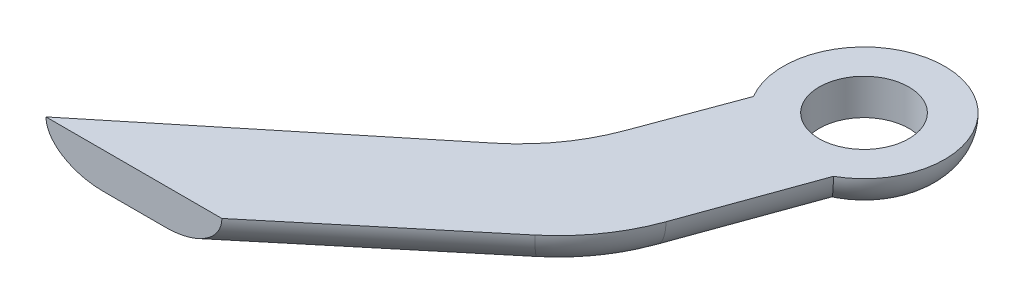
ISO-10303-21;
HEADER;
FILE_DESCRIPTION(('STEP AP214'),'2;1');
FILE_NAME('part.step','',(''),(''),'','','');
FILE_SCHEMA(('AUTOMOTIVE_DESIGN { 1 0 10303 214 1 1 1 1 }'));
ENDSEC;
DATA;
#1=APPLICATION_CONTEXT('core data for automotive mechanical design processes');
#2=APPLICATION_PROTOCOL_DEFINITION('international standard','automotive_design',2000,#1);
#3=PRODUCT_CONTEXT('',#1,'mechanical');
#4=PRODUCT('Part','Part','',(#3));
#5=PRODUCT_RELATED_PRODUCT_CATEGORY('part','',(#4));
#6=PRODUCT_DEFINITION_FORMATION('','',#4);
#7=PRODUCT_DEFINITION_CONTEXT('part definition',#1,'design');
#8=PRODUCT_DEFINITION('design','',#6,#7);
#9=PRODUCT_DEFINITION_SHAPE('','',#8);
#10=(LENGTH_UNIT() NAMED_UNIT(*) SI_UNIT(.MILLI.,.METRE.));
#11=(NAMED_UNIT(*) PLANE_ANGLE_UNIT() SI_UNIT($,.RADIAN.));
#12=(NAMED_UNIT(*) SI_UNIT($,.STERADIAN.) SOLID_ANGLE_UNIT());
#13=UNCERTAINTY_MEASURE_WITH_UNIT(LENGTH_MEASURE(1.E-05),#10,'distance_accuracy_value','');
#14=(GEOMETRIC_REPRESENTATION_CONTEXT(3) GLOBAL_UNCERTAINTY_ASSIGNED_CONTEXT((#13)) GLOBAL_UNIT_ASSIGNED_CONTEXT((#10,
#11,#12)) REPRESENTATION_CONTEXT('',''));
#15=CARTESIAN_POINT('',(0.,0.,0.));
#16=DIRECTION('',(0.,0.,1.));
#17=DIRECTION('',(1.,0.,0.));
#18=AXIS2_PLACEMENT_3D('',#15,#16,#17);
#19=CARTESIAN_POINT('',(11.4826257965562,2.,-14.3996307201945));
#20=DIRECTION('',(0.,1.,0.));
#21=DIRECTION('',(0.,0.,1.));
#22=AXIS2_PLACEMENT_3D('',#19,#20,#21);
#23=PLANE('',#22);
#24=DIRECTION('',(0.768811989561023,0.,-0.639474881998676));
#25=VECTOR('',#24,1.);
#26=CARTESIAN_POINT('',(-1.31921636014026,2.,8.60036927980545));
#27=LINE('',#26,#25);
#28=CARTESIAN_POINT('',(-1.31921636014026,2.,8.60036927980545));
#29=VERTEX_POINT('',#28);
#30=CARTESIAN_POINT('',(8.20702119077927,2.,0.676729018622842));
#31=VERTEX_POINT('',#30);
#32=EDGE_CURVE('E124',#29,#31,#27,.T.);
#33=ORIENTED_EDGE('',*,*,#32,.T.);
#34=CARTESIAN_POINT('',(1.8122723707925,2.,-7.01139087698739));
#35=DIRECTION('',(0.,1.,0.));
#36=DIRECTION('',(0.,0.,1.));
#37=AXIS2_PLACEMENT_3D('',#34,#35,#36);
#38=CIRCLE('',#37,10.);
#39=CARTESIAN_POINT('',(11.2193056553227,2.,-3.6190871194002));
#40=VERTEX_POINT('',#39);
#41=EDGE_CURVE('E202',#31,#40,#38,.T.);
#42=ORIENTED_EDGE('',*,*,#41,.T.);
#43=DIRECTION('',(0.339230375758719,0.,-0.940703328453024));
#44=VECTOR('',#43,1.);
#45=CARTESIAN_POINT('',(10.2970860518292,2.,-1.06172459362196));
#46=LINE('',#45,#44);
#47=CARTESIAN_POINT('',(13.693514413313,2.,-10.4801956174922));
#48=VERTEX_POINT('',#47);
#49=EDGE_CURVE('E199',#40,#48,#46,.T.);
#50=ORIENTED_EDGE('',*,*,#49,.T.);
#51=CARTESIAN_POINT('',(11.4826257965562,2.,-14.3996307201945));
#52=DIRECTION('',(0.,1.,0.));
#53=DIRECTION('',(0.,0.,1.));
#54=AXIS2_PLACEMENT_3D('',#51,#52,#53);
#55=CIRCLE('',#54,4.5);
#56=CARTESIAN_POINT('',(7.61190342688268,2.,-12.1045254204515));
#57=VERTEX_POINT('',#56);
#58=EDGE_CURVE('E196',#48,#57,#55,.T.);
#59=ORIENTED_EDGE('',*,*,#58,.T.);
#60=DIRECTION('',(-0.347398248181745,0.,0.937717685212482));
#61=VECTOR('',#60,1.);
#62=CARTESIAN_POINT('',(7.61190342688268,2.,-12.1045254204515));
#63=LINE('',#62,#61);
#64=CARTESIAN_POINT('',(5.68031595775114,2.,-6.89067146517223));
#65=VERTEX_POINT('',#64);
#66=EDGE_CURVE('E115',#57,#65,#63,.T.);
#67=ORIENTED_EDGE('',*,*,#66,.T.);
#68=CARTESIAN_POINT('',(-3.69686089437368,2.,-10.3646539469897));
#69=DIRECTION('',(0.,1.,0.));
#70=DIRECTION('',(0.,0.,1.));
#71=AXIS2_PLACEMENT_3D('',#68,#69,#70);
#72=CIRCLE('',#71,10.);
#73=CARTESIAN_POINT('',(2.62475748019861,2.,-2.61629017608488));
#74=VERTEX_POINT('',#73);
#75=EDGE_CURVE('E110',#65,#74,#72,.F.);
#76=ORIENTED_EDGE('',*,*,#75,.T.);
#77=DIRECTION('',(-0.77483637709048,0.,0.632161837457229));
#78=VECTOR('',#77,1.);
#79=CARTESIAN_POINT('',(4.73443918794363,2.,-4.33750552457679));
#80=LINE('',#79,#78);
#81=CARTESIAN_POINT('',(-11.1234241734397,2.,8.60036927980545));
#82=VERTEX_POINT('',#81);
#83=EDGE_CURVE('E103',#74,#82,#80,.T.);
#84=ORIENTED_EDGE('',*,*,#83,.T.);
#85=DIRECTION('',(1.,0.,0.));
#86=VECTOR('',#85,1.);
#87=CARTESIAN_POINT('',(-11.1234241734397,2.,8.60036927980545));
#88=LINE('',#87,#86);
#89=EDGE_CURVE('E106',#82,#29,#88,.T.);
#90=ORIENTED_EDGE('',*,*,#89,.T.);
#91=EDGE_LOOP('',(#33,#42,#50,#59,#67,#76,#84,#90));
#92=FACE_BOUND('',#91,.T.);
#93=CARTESIAN_POINT('',(11.4826257965562,2.,-14.3996307201945));
#94=DIRECTION('',(0.,1.,0.));
#95=DIRECTION('',(0.,0.,1.));
#96=AXIS2_PLACEMENT_3D('',#93,#94,#95);
#97=CIRCLE('',#96,2.5);
#98=CARTESIAN_POINT('',(11.4826257965562,2.,-11.8996307201945));
#99=VERTEX_POINT('',#98);
#100=EDGE_CURVE('E186',#99,#99,#97,.T.);
#101=ORIENTED_EDGE('',*,*,#100,.F.);
#102=EDGE_LOOP('',(#101));
#103=FACE_BOUND('',#102,.T.);
#104=ADVANCED_FACE('F34',(#92,#103),#23,.T.);
#105=CARTESIAN_POINT('',(11.4826257965562,0.,-14.3996307201945));
#106=DIRECTION('',(0.,1.,0.));
#107=DIRECTION('',(0.,0.,1.));
#108=AXIS2_PLACEMENT_3D('',#105,#106,#107);
#109=PLANE('',#108);
#110=DIRECTION('',(-0.347398248181745,0.,0.937717685212482));
#111=VECTOR('',#110,1.);
#112=CARTESIAN_POINT('',(10.7021359294715,0.,-14.6887804470523));
#113=LINE('',#112,#111);
#114=CARTESIAN_POINT('',(7.5557513281761,0.,-6.19587496880874));
#115=VERTEX_POINT('',#114);
#116=CARTESIAN_POINT('',(9.88318716538032,0.,-12.4782260087654));
#117=VERTEX_POINT('',#116);
#118=EDGE_CURVE('E54',#115,#117,#113,.F.);
#119=ORIENTED_EDGE('',*,*,#118,.T.);
#120=CARTESIAN_POINT('',(11.4826257965562,0.,-14.3996307201945));
#121=DIRECTION('',(0.,1.,0.));
#122=DIRECTION('',(0.,0.,1.));
#123=AXIS2_PLACEMENT_3D('',#120,#121,#122);
#124=CIRCLE('',#123,2.5);
#125=CARTESIAN_POINT('',(12.1079729417804,0.,-11.9791057878793));
#126=VERTEX_POINT('',#125);
#127=EDGE_CURVE('E138',#117,#126,#124,.T.);
#128=ORIENTED_EDGE('',*,*,#127,.T.);
#129=DIRECTION('',(0.339230375758719,0.,-0.940703328453024));
#130=VECTOR('',#129,1.);
#131=CARTESIAN_POINT('',(12.8084358747006,0.,-13.921525628621));
#132=LINE('',#131,#130);
#133=CARTESIAN_POINT('',(9.3378989984167,0.,-4.29754787091764));
#134=VERTEX_POINT('',#133);
#135=EDGE_CURVE('E61',#126,#134,#132,.F.);
#136=ORIENTED_EDGE('',*,*,#135,.T.);
#137=CARTESIAN_POINT('',(1.8122723707925,0.,-7.01139087698739));
#138=DIRECTION('',(0.,1.,0.));
#139=DIRECTION('',(0.,0.,1.));
#140=AXIS2_PLACEMENT_3D('',#137,#138,#139);
#141=CIRCLE('',#140,8.);
#142=CARTESIAN_POINT('',(6.92807142678192,0.,-0.860894960499205));
#143=VERTEX_POINT('',#142);
#144=EDGE_CURVE('E214',#134,#143,#141,.F.);
#145=ORIENTED_EDGE('',*,*,#144,.T.);
#146=DIRECTION('',(0.768811989561023,0.,-0.639474881998676));
#147=VECTOR('',#146,1.);
#148=CARTESIAN_POINT('',(16.2762697216083,0.,-8.63644747873922));
#149=LINE('',#148,#147);
#150=CARTESIAN_POINT('',(-4.44678251840594,0.,8.60036927980545));
#151=VERTEX_POINT('',#150);
#152=EDGE_CURVE('E212',#143,#151,#149,.F.);
#153=ORIENTED_EDGE('',*,*,#152,.T.);
#154=DIRECTION('',(1.,0.,0.));
#155=VECTOR('',#154,1.);
#156=CARTESIAN_POINT('',(-11.1234241734397,0.,8.60036927980545));
#157=LINE('',#156,#155);
#158=CARTESIAN_POINT('',(-7.95967735815469,0.,8.60036927980545));
#159=VERTEX_POINT('',#158);
#160=EDGE_CURVE('E208',#159,#151,#157,.T.);
#161=ORIENTED_EDGE('',*,*,#160,.F.);
#162=DIRECTION('',(-0.77483637709048,0.,0.632161837457229));
#163=VECTOR('',#162,1.);
#164=CARTESIAN_POINT('',(14.9788313460514,0.,-10.1143558411684));
#165=LINE('',#164,#163);
#166=CARTESIAN_POINT('',(3.88908115511307,0.,-1.06661742190392));
#167=VERTEX_POINT('',#166);
#168=EDGE_CURVE('E128',#159,#167,#165,.F.);
#169=ORIENTED_EDGE('',*,*,#168,.T.);
#170=CARTESIAN_POINT('',(-3.69686089437368,0.,-10.3646539469897));
#171=DIRECTION('',(0.,1.,0.));
#172=DIRECTION('',(0.,0.,1.));
#173=AXIS2_PLACEMENT_3D('',#170,#171,#172);
#174=CIRCLE('',#173,12.);
#175=EDGE_CURVE('E218',#167,#115,#174,.T.);
#176=ORIENTED_EDGE('',*,*,#175,.T.);
#177=EDGE_LOOP('',(#119,#128,#136,#145,#153,#161,#169,#176));
#178=FACE_BOUND('',#177,.T.);
#179=ADVANCED_FACE('F172',(#178),#109,.F.);
#180=CARTESIAN_POINT('',(-11.1234241734397,2.,8.60036927980545));
#181=DIRECTION('',(0.,0.,-1.));
#182=DIRECTION('',(-1.,0.,0.));
#183=AXIS2_PLACEMENT_3D('',#180,#181,#182);
#184=PLANE('',#183);
#185=ORIENTED_EDGE('',*,*,#89,.F.);
#186=CARTESIAN_POINT('',(-7.95967735815469,2.,8.60036927980545));
#187=DIRECTION('',(0.,0.,-1.));
#188=DIRECTION('',(-1.,0.,0.));
#189=AXIS2_PLACEMENT_3D('',#186,#187,#188);
#190=ELLIPSE('',#189,3.16374681528496,2.);
#191=EDGE_CURVE('E120',#82,#159,#190,.F.);
#192=ORIENTED_EDGE('',*,*,#191,.T.);
#193=ORIENTED_EDGE('',*,*,#160,.T.);
#194=CARTESIAN_POINT('',(-4.44678251840594,2.,8.60036927980545));
#195=DIRECTION('',(0.,0.,-1.));
#196=DIRECTION('',(1.,0.,0.));
#197=AXIS2_PLACEMENT_3D('',#194,#195,#196);
#198=ELLIPSE('',#197,3.12756615826568,2.);
#199=EDGE_CURVE('E123',#151,#29,#198,.F.);
#200=ORIENTED_EDGE('',*,*,#199,.T.);
#201=EDGE_LOOP('',(#185,#192,#193,#200));
#202=FACE_BOUND('',#201,.T.);
#203=ADVANCED_FACE('F118',(#202),#184,.F.);
#204=CARTESIAN_POINT('',(11.4826257965562,2.,-14.3996307201945));
#205=DIRECTION('',(0.,-1.,0.));
#206=DIRECTION('',(0.,0.,-1.));
#207=AXIS2_PLACEMENT_3D('',#204,#205,#206);
#208=CYLINDRICAL_SURFACE('',#207,2.5);
#209=ORIENTED_EDGE('',*,*,#100,.T.);
#210=EDGE_LOOP('',(#209));
#211=FACE_BOUND('',#210,.T.);
#212=EDGE_CURVE('E190',#126,#117,#124,.T.);
#213=ORIENTED_EDGE('',*,*,#212,.F.);
#214=ORIENTED_EDGE('',*,*,#127,.F.);
#215=EDGE_LOOP('',(#213,#214));
#216=FACE_BOUND('',#215,.T.);
#217=ADVANCED_FACE('F159',(#211,#216),#208,.F.);
#218=CARTESIAN_POINT('',(5.99876286285809,2.,-2.78783277039583));
#219=DIRECTION('',(-0.77483637709048,0.,0.632161837457229));
#220=DIRECTION('',(0.632161837457229,0.,0.77483637709048));
#221=AXIS2_PLACEMENT_3D('',#218,#219,#220);
#222=CYLINDRICAL_SURFACE('',#221,2.);
#223=ORIENTED_EDGE('',*,*,#191,.F.);
#224=ORIENTED_EDGE('',*,*,#83,.F.);
#225=CARTESIAN_POINT('',(3.88908115511307,2.,-1.06661742190392));
#226=DIRECTION('',(0.77483637709048,0.,-0.632161837457229));
#227=DIRECTION('',(-0.632161837457229,0.,-0.77483637709048));
#228=AXIS2_PLACEMENT_3D('',#225,#226,#227);
#229=CIRCLE('',#228,2.);
#230=EDGE_CURVE('E135',#167,#74,#229,.T.);
#231=ORIENTED_EDGE('',*,*,#230,.F.);
#232=ORIENTED_EDGE('',*,*,#168,.F.);
#233=EDGE_LOOP('',(#223,#224,#231,#232));
#234=FACE_BOUND('',#233,.T.);
#235=ADVANCED_FACE('F127',(#234),#222,.T.);
#236=CARTESIAN_POINT('',(-3.69686089437368,2.,-10.3646539469897));
#237=DIRECTION('',(0.,1.,0.));
#238=DIRECTION('',(0.,0.,1.));
#239=AXIS2_PLACEMENT_3D('',#236,#237,#238);
#240=TOROIDAL_SURFACE('',#239,12.,2.);
#241=ORIENTED_EDGE('',*,*,#230,.T.);
#242=ORIENTED_EDGE('',*,*,#75,.F.);
#243=CARTESIAN_POINT('',(7.5557513281761,2.,-6.19587496880874));
#244=DIRECTION('',(0.347398248181745,0.,-0.937717685212482));
#245=DIRECTION('',(-0.937717685212482,0.,-0.347398248181745));
#246=AXIS2_PLACEMENT_3D('',#243,#244,#245);
#247=CIRCLE('',#246,2.);
#248=EDGE_CURVE('E133',#115,#65,#247,.T.);
#249=ORIENTED_EDGE('',*,*,#248,.F.);
#250=ORIENTED_EDGE('',*,*,#175,.F.);
#251=EDGE_LOOP('',(#241,#242,#249,#250));
#252=FACE_BOUND('',#251,.T.);
#253=ADVANCED_FACE('F152',(#252),#240,.T.);
#254=CARTESIAN_POINT('',(9.48733879730765,2.,-11.409728924088));
#255=DIRECTION('',(-0.347398248181745,0.,0.937717685212482));
#256=DIRECTION('',(0.937717685212482,0.,0.347398248181745));
#257=AXIS2_PLACEMENT_3D('',#254,#255,#256);
#258=CYLINDRICAL_SURFACE('',#257,2.);
#259=ORIENTED_EDGE('',*,*,#66,.F.);
#260=CARTESIAN_POINT('',(7.61190342688268,2.,-12.1045254204515));
#261=CARTESIAN_POINT('',(7.61189543352078,1.94797161246337,-12.1045262232534));
#262=CARTESIAN_POINT('',(7.61414339430645,1.89594703558025,-12.1047280739774));
#263=CARTESIAN_POINT('',(7.62308994926808,1.79229556153906,-12.105539429095));
#264=CARTESIAN_POINT('',(7.62978763009234,1.74066858496881,-12.1061488498307));
#265=CARTESIAN_POINT('',(7.6475467799877,1.63832832712275,-12.1077785477575));
#266=CARTESIAN_POINT('',(7.65859562252087,1.58761284216087,-12.1087976363189));
#267=CARTESIAN_POINT('',(7.68492912514579,1.48731807740263,-12.1112567415172));
#268=CARTESIAN_POINT('',(7.70021385815536,1.43773881718148,-12.1126967654001));
#269=CARTESIAN_POINT('',(7.75219834246821,1.29125228992072,-12.1176685979388));
#270=CARTESIAN_POINT('',(7.79504999413708,1.19647368864975,-12.1218540280005));
#271=CARTESIAN_POINT('',(7.89544489323164,1.01521923926278,-12.1321135387336));
#272=CARTESIAN_POINT('',(7.95299390003438,0.928746664308471,-12.1381883599949));
#273=CARTESIAN_POINT('',(8.08277301030972,0.76331630024433,-12.1526471361493));
#274=CARTESIAN_POINT('',(8.15541305794058,0.68468644081365,-12.1610986019576));
#275=CARTESIAN_POINT('',(8.31166308370237,0.539619289635113,-12.1804522363457));
#276=CARTESIAN_POINT('',(8.39527542737518,0.473184634508815,-12.1913549337545));
#277=CARTESIAN_POINT('',(8.57861945643107,0.348091659981006,-12.2169281844484));
#278=CARTESIAN_POINT('',(8.67912074017512,0.290613681895938,-12.23184411115));
#279=CARTESIAN_POINT('',(8.88709032135319,0.191352219674169,-12.2651943235526));
#280=CARTESIAN_POINT('',(8.99456485297788,0.149583012573472,-12.2836317869956));
#281=CARTESIAN_POINT('',(9.22965456264571,0.0765945474507016,-12.327317552917));
#282=CARTESIAN_POINT('',(9.35791266490508,0.0478193952913946,-12.3531680620895));
#283=CARTESIAN_POINT('',(9.61586564248933,0.00975062089641697,-12.4103304088893));
#284=CARTESIAN_POINT('',(9.74555771894424,0.000424111407126259,-12.4416329299717));
#285=CARTESIAN_POINT('',(9.87725407027953,4.69634166260889E-06,-12.4766436593888));
#286=CARTESIAN_POINT('',(9.88022088463565,-1.59677907326687E-08,-12.4774340574169));
#287=CARTESIAN_POINT('',(9.88318716538032,0.,-12.4782260087654));
#288=B_SPLINE_CURVE_WITH_KNOTS('',3,(#260,#261,#262,#263,#264,#265,#266,#267,#268,#269,#270,
#271,#272,#273,#274,#275,#276,#277,#278,#279,#280,#281,#282,#283,#284,#285,#286,#287),
.UNSPECIFIED.,.F.,.F.,(4,2,2,2,2,2,2,2,2,2,2,2,2,4),(0.,0.156029713161231,0.312027409478255,
0.467575716396317,0.62312670113319,0.933859930965682,1.24471511357013,1.5654916485293,
1.88633745438656,2.23511270915112,2.58420418928672,2.98446938566176,3.38405719116916,
3.39326806890228),.UNSPECIFIED.);
#289=EDGE_CURVE('E47',#57,#117,#288,.T.);
#290=ORIENTED_EDGE('',*,*,#289,.T.);
#291=ORIENTED_EDGE('',*,*,#118,.F.);
#292=ORIENTED_EDGE('',*,*,#248,.T.);
#293=EDGE_LOOP('',(#259,#290,#291,#292));
#294=FACE_BOUND('',#293,.T.);
#295=ADVANCED_FACE('F146',(#294),#258,.T.);
#296=CARTESIAN_POINT('',(-2.59816612413761,2.,7.0627453006834));
#297=DIRECTION('',(0.768811989561023,0.,-0.639474881998676));
#298=DIRECTION('',(-0.639474881998676,0.,-0.768811989561023));
#299=AXIS2_PLACEMENT_3D('',#296,#297,#298);
#300=CYLINDRICAL_SURFACE('',#299,2.);
#301=ORIENTED_EDGE('',*,*,#199,.F.);
#302=ORIENTED_EDGE('',*,*,#152,.F.);
#303=CARTESIAN_POINT('',(6.92807142678192,2.,-0.860894960499205));
#304=DIRECTION('',(0.768811989561023,0.,-0.639474881998676));
#305=DIRECTION('',(-0.639474881998676,0.,-0.768811989561023));
#306=AXIS2_PLACEMENT_3D('',#303,#304,#305);
#307=CIRCLE('',#306,2.);
#308=EDGE_CURVE('E136',#31,#143,#307,.T.);
#309=ORIENTED_EDGE('',*,*,#308,.F.);
#310=ORIENTED_EDGE('',*,*,#32,.F.);
#311=EDGE_LOOP('',(#301,#302,#309,#310));
#312=FACE_BOUND('',#311,.T.);
#313=ADVANCED_FACE('F151',(#312),#300,.T.);
#314=CARTESIAN_POINT('',(1.8122723707925,2.,-7.01139087698739));
#315=DIRECTION('',(0.,1.,0.));
#316=DIRECTION('',(0.,0.,1.));
#317=AXIS2_PLACEMENT_3D('',#314,#315,#316);
#318=TOROIDAL_SURFACE('',#317,8.,2.);
#319=ORIENTED_EDGE('',*,*,#308,.T.);
#320=ORIENTED_EDGE('',*,*,#144,.F.);
#321=CARTESIAN_POINT('',(9.3378989984167,2.,-4.29754787091764));
#322=DIRECTION('',(0.339230375758719,0.,-0.940703328453024));
#323=DIRECTION('',(-0.940703328453024,0.,-0.339230375758719));
#324=AXIS2_PLACEMENT_3D('',#321,#322,#323);
#325=CIRCLE('',#324,2.);
#326=EDGE_CURVE('E139',#40,#134,#325,.T.);
#327=ORIENTED_EDGE('',*,*,#326,.F.);
#328=ORIENTED_EDGE('',*,*,#41,.F.);
#329=EDGE_LOOP('',(#319,#320,#327,#328));
#330=FACE_BOUND('',#329,.T.);
#331=ADVANCED_FACE('F164',(#330),#318,.T.);
#332=CARTESIAN_POINT('',(8.41567939492314,2.,-1.7401853451394));
#333=DIRECTION('',(0.339230375758719,0.,-0.940703328453024));
#334=DIRECTION('',(-0.940703328453024,0.,-0.339230375758719));
#335=AXIS2_PLACEMENT_3D('',#332,#333,#334);
#336=CYLINDRICAL_SURFACE('',#335,2.);
#337=ORIENTED_EDGE('',*,*,#326,.T.);
#338=ORIENTED_EDGE('',*,*,#135,.F.);
#339=CARTESIAN_POINT('',(13.693514413313,2.,-10.4801956174922));
#340=CARTESIAN_POINT('',(13.6935206015833,1.94647094845797,-10.4801920632802));
#341=CARTESIAN_POINT('',(13.6917636364918,1.89294525970464,-10.4816752709105));
#342=CARTESIAN_POINT('',(13.6847706272418,1.78629295991481,-10.4875874777269));
#343=CARTESIAN_POINT('',(13.6795350977507,1.7331662910175,-10.4920160411361));
#344=CARTESIAN_POINT('',(13.6656469622341,1.62780060898106,-10.5037787069259));
#345=CARTESIAN_POINT('',(13.6570016554297,1.57555994672415,-10.5111066028867));
#346=CARTESIAN_POINT('',(13.6363943848645,1.47223655971397,-10.5286070655638));
#347=CARTESIAN_POINT('',(13.6244323997996,1.42115384240081,-10.5387796505525));
#348=CARTESIAN_POINT('',(13.5837393605981,1.27018038251834,-10.5734676457845));
#349=CARTESIAN_POINT('',(13.5501882878966,1.17246774766914,-10.6021641468197));
#350=CARTESIAN_POINT('',(13.4716192624409,0.985678518852981,-10.6698749951854));
#351=CARTESIAN_POINT('',(13.4265992827097,0.896603455308139,-10.7088911664272));
#352=CARTESIAN_POINT('',(13.3257203823923,0.727334799373857,-10.7971814060579));
#353=CARTESIAN_POINT('',(13.2696490582893,0.647373586018656,-10.8466581543752));
#354=CARTESIAN_POINT('',(13.1493973648619,0.500311076124678,-10.9541068178581));
#355=CARTESIAN_POINT('',(13.0852150322487,0.433212903045907,-11.0120807903417));
#356=CARTESIAN_POINT('',(12.9471257908999,0.309609195597523,-11.1387261646872));
#357=CARTESIAN_POINT('',(12.8728736116376,0.253921664797636,-11.2078181125366));
#358=CARTESIAN_POINT('',(12.7203459894761,0.158907196256941,-11.3525316463373));
#359=CARTESIAN_POINT('',(12.6420687196115,0.119587762876743,-11.4281562081838));
#360=CARTESIAN_POINT('',(12.4882816488727,0.0591602497511942,-11.5802164512471));
#361=CARTESIAN_POINT('',(12.412847993636,0.0371900149889169,-11.6563920333859));
#362=CARTESIAN_POINT('',(12.2627109958039,0.0078428192906722,-11.811982496122));
#363=CARTESIAN_POINT('',(12.1880065576385,0.000438850248578032,-11.891391102499));
#364=CARTESIAN_POINT('',(12.11239205861,6.29203840483205E-06,-11.9742562173392));
#365=CARTESIAN_POINT('',(12.1101818959228,-1.95465007629301E-08,-11.9766805427118));
#366=CARTESIAN_POINT('',(12.1079729417804,0.,-11.9791057878793));
#367=B_SPLINE_CURVE_WITH_KNOTS('',3,(#339,#340,#341,#342,#343,#344,#345,#346,#347,#348,#349,
#350,#351,#352,#353,#354,#355,#356,#357,#358,#359,#360,#361,#362,#363,#364,#365,#366),
.UNSPECIFIED.,.F.,.F.,(4,2,2,2,2,2,2,2,2,2,2,2,2,4),(0.,0.16053195849016,0.321040170924062,
0.481206636430516,0.641374130760215,0.961418689782529,1.28151985172015,1.60850954501276,
1.93557853908486,2.28122266166902,2.62702507931526,2.95431744541945,3.28100238685324,
3.29084409847999),.UNSPECIFIED.);
#368=EDGE_CURVE('E11',#126,#48,#367,.F.);
#369=ORIENTED_EDGE('',*,*,#368,.T.);
#370=ORIENTED_EDGE('',*,*,#49,.F.);
#371=EDGE_LOOP('',(#337,#338,#369,#370));
#372=FACE_BOUND('',#371,.T.);
#373=ADVANCED_FACE('F160',(#372),#336,.T.);
#374=CARTESIAN_POINT('',(11.4826257965562,2.,-14.3996307201945));
#375=DIRECTION('',(0.,1.,0.));
#376=DIRECTION('',(0.,0.,1.));
#377=AXIS2_PLACEMENT_3D('',#374,#375,#376);
#378=TOROIDAL_SURFACE('',#377,2.5,2.);
#379=ORIENTED_EDGE('',*,*,#368,.F.);
#380=ORIENTED_EDGE('',*,*,#212,.T.);
#381=ORIENTED_EDGE('',*,*,#289,.F.);
#382=ORIENTED_EDGE('',*,*,#58,.F.);
#383=EDGE_LOOP('',(#379,#380,#381,#382));
#384=FACE_BOUND('',#383,.T.);
#385=ADVANCED_FACE('F36',(#384),#378,.T.);
#386=CLOSED_SHELL('',(#104,#179,#203,#217,#235,#253,#295,#313,#331,#373,#385));
#387=MANIFOLD_SOLID_BREP('B2',#386);
#388=ADVANCED_BREP_SHAPE_REPRESENTATION('',(#18,#387),#14);
#389=SHAPE_DEFINITION_REPRESENTATION(#9,#388);
ENDSEC;
END-ISO-10303-21;
